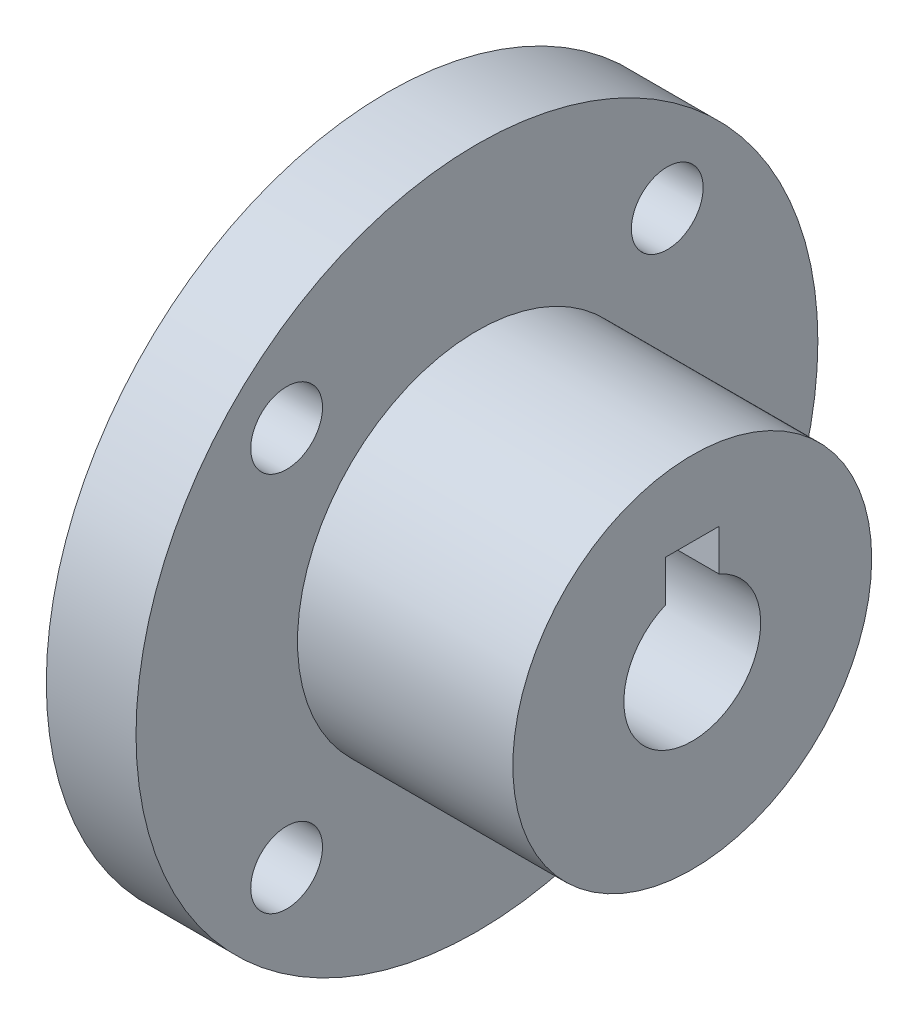
ISO-10303-21;
HEADER;
FILE_DESCRIPTION(('STEP AP214'),'2;1');
FILE_NAME('part.step','',(''),(''),'','','');
FILE_SCHEMA(('AUTOMOTIVE_DESIGN { 1 0 10303 214 1 1 1 1 }'));
ENDSEC;
DATA;
#1=APPLICATION_CONTEXT('core data for automotive mechanical design processes');
#2=APPLICATION_PROTOCOL_DEFINITION('international standard','automotive_design',2000,#1);
#3=PRODUCT_CONTEXT('',#1,'mechanical');
#4=PRODUCT('Part','Part','',(#3));
#5=PRODUCT_RELATED_PRODUCT_CATEGORY('part','',(#4));
#6=PRODUCT_DEFINITION_FORMATION('','',#4);
#7=PRODUCT_DEFINITION_CONTEXT('part definition',#1,'design');
#8=PRODUCT_DEFINITION('design','',#6,#7);
#9=PRODUCT_DEFINITION_SHAPE('','',#8);
#10=(LENGTH_UNIT() NAMED_UNIT(*) SI_UNIT(.MILLI.,.METRE.));
#11=(NAMED_UNIT(*) PLANE_ANGLE_UNIT() SI_UNIT($,.RADIAN.));
#12=(NAMED_UNIT(*) SI_UNIT($,.STERADIAN.) SOLID_ANGLE_UNIT());
#13=UNCERTAINTY_MEASURE_WITH_UNIT(LENGTH_MEASURE(1.E-05),#10,'distance_accuracy_value','');
#14=(GEOMETRIC_REPRESENTATION_CONTEXT(3) GLOBAL_UNCERTAINTY_ASSIGNED_CONTEXT((#13)) GLOBAL_UNIT_ASSIGNED_CONTEXT((#10,
#11,#12)) REPRESENTATION_CONTEXT('',''));
#15=CARTESIAN_POINT('',(0.,0.,0.));
#16=DIRECTION('',(0.,0.,1.));
#17=DIRECTION('',(1.,0.,0.));
#18=AXIS2_PLACEMENT_3D('',#15,#16,#17);
#19=CARTESIAN_POINT('',(12.,0.,0.));
#20=DIRECTION('',(-1.,0.,0.));
#21=DIRECTION('',(0.,0.,1.));
#22=AXIS2_PLACEMENT_3D('',#19,#20,#21);
#23=CYLINDRICAL_SURFACE('',#22,10.);
#24=CARTESIAN_POINT('',(12.,0.,0.));
#25=DIRECTION('',(1.,0.,0.));
#26=DIRECTION('',(0.,0.,-1.));
#27=AXIS2_PLACEMENT_3D('',#24,#25,#26);
#28=CIRCLE('',#27,10.);
#29=CARTESIAN_POINT('',(12.,0.,-10.));
#30=VERTEX_POINT('',#29);
#31=EDGE_CURVE('E135',#30,#30,#28,.T.);
#32=ORIENTED_EDGE('',*,*,#31,.F.);
#33=EDGE_LOOP('',(#32));
#34=FACE_BOUND('',#33,.T.);
#35=CARTESIAN_POINT('',(0.,0.,0.));
#36=DIRECTION('',(1.,0.,0.));
#37=DIRECTION('',(0.,0.,-1.));
#38=AXIS2_PLACEMENT_3D('',#35,#36,#37);
#39=CIRCLE('',#38,10.);
#40=CARTESIAN_POINT('',(0.,0.,-10.));
#41=VERTEX_POINT('',#40);
#42=EDGE_CURVE('E132',#41,#41,#39,.T.);
#43=ORIENTED_EDGE('',*,*,#42,.T.);
#44=EDGE_LOOP('',(#43));
#45=FACE_BOUND('',#44,.T.);
#46=ADVANCED_FACE('F33',(#34,#45),#23,.T.);
#47=CARTESIAN_POINT('',(12.,0.,0.));
#48=DIRECTION('',(1.,0.,0.));
#49=DIRECTION('',(0.,0.,-1.));
#50=AXIS2_PLACEMENT_3D('',#47,#48,#49);
#51=PLANE('',#50);
#52=DIRECTION('',(0.,-1.,0.));
#53=VECTOR('',#52,1.);
#54=CARTESIAN_POINT('',(12.,5.8125,1.5));
#55=LINE('',#54,#53);
#56=CARTESIAN_POINT('',(12.,5.8125,1.5));
#57=VERTEX_POINT('',#56);
#58=CARTESIAN_POINT('',(12.,3.50501872320249,1.5));
#59=VERTEX_POINT('',#58);
#60=EDGE_CURVE('E95',#57,#59,#55,.T.);
#61=ORIENTED_EDGE('',*,*,#60,.F.);
#62=DIRECTION('',(0.,0.,1.));
#63=VECTOR('',#62,1.);
#64=CARTESIAN_POINT('',(12.,5.8125,1.5));
#65=LINE('',#64,#63);
#66=CARTESIAN_POINT('',(12.,5.8125,-1.5));
#67=VERTEX_POINT('',#66);
#68=EDGE_CURVE('E92',#67,#57,#65,.T.);
#69=ORIENTED_EDGE('',*,*,#68,.F.);
#70=DIRECTION('',(0.,1.,0.));
#71=VECTOR('',#70,1.);
#72=CARTESIAN_POINT('',(12.,5.8125,-1.5));
#73=LINE('',#72,#71);
#74=CARTESIAN_POINT('',(12.,3.50501872320249,-1.5));
#75=VERTEX_POINT('',#74);
#76=EDGE_CURVE('E74',#75,#67,#73,.T.);
#77=ORIENTED_EDGE('',*,*,#76,.F.);
#78=CARTESIAN_POINT('',(12.,0.,0.));
#79=DIRECTION('',(1.,0.,0.));
#80=DIRECTION('',(0.,0.,-1.));
#81=AXIS2_PLACEMENT_3D('',#78,#79,#80);
#82=CIRCLE('',#81,3.8125);
#83=EDGE_CURVE('E99',#59,#75,#82,.T.);
#84=ORIENTED_EDGE('',*,*,#83,.F.);
#85=EDGE_LOOP('',(#61,#69,#77,#84));
#86=FACE_BOUND('',#85,.T.);
#87=ORIENTED_EDGE('',*,*,#31,.T.);
#88=EDGE_LOOP('',(#87));
#89=FACE_BOUND('',#88,.T.);
#90=ADVANCED_FACE('F144',(#86,#89),#51,.T.);
#91=CARTESIAN_POINT('',(-5.,0.,0.));
#92=DIRECTION('',(-1.,0.,0.));
#93=DIRECTION('',(0.,0.,1.));
#94=AXIS2_PLACEMENT_3D('',#91,#92,#93);
#95=PLANE('',#94);
#96=DIRECTION('',(0.,-1.,0.));
#97=VECTOR('',#96,1.);
#98=CARTESIAN_POINT('',(-5.,5.8125,1.5));
#99=LINE('',#98,#97);
#100=CARTESIAN_POINT('',(-5.,5.8125,1.5));
#101=VERTEX_POINT('',#100);
#102=CARTESIAN_POINT('',(-5.,3.50501872320249,1.5));
#103=VERTEX_POINT('',#102);
#104=EDGE_CURVE('E90',#101,#103,#99,.T.);
#105=ORIENTED_EDGE('',*,*,#104,.T.);
#106=CARTESIAN_POINT('',(-5.,0.,0.));
#107=DIRECTION('',(1.,0.,0.));
#108=DIRECTION('',(0.,0.,-1.));
#109=AXIS2_PLACEMENT_3D('',#106,#107,#108);
#110=CIRCLE('',#109,3.8125);
#111=CARTESIAN_POINT('',(-5.,3.50501872320249,-1.5));
#112=VERTEX_POINT('',#111);
#113=EDGE_CURVE('E89',#103,#112,#110,.T.);
#114=ORIENTED_EDGE('',*,*,#113,.T.);
#115=DIRECTION('',(0.,1.,0.));
#116=VECTOR('',#115,1.);
#117=CARTESIAN_POINT('',(-5.,5.8125,-1.5));
#118=LINE('',#117,#116);
#119=CARTESIAN_POINT('',(-5.,5.8125,-1.5));
#120=VERTEX_POINT('',#119);
#121=EDGE_CURVE('E47',#112,#120,#118,.T.);
#122=ORIENTED_EDGE('',*,*,#121,.T.);
#123=DIRECTION('',(0.,0.,1.));
#124=VECTOR('',#123,1.);
#125=CARTESIAN_POINT('',(-5.,5.8125,1.5));
#126=LINE('',#125,#124);
#127=EDGE_CURVE('E79',#120,#101,#126,.T.);
#128=ORIENTED_EDGE('',*,*,#127,.T.);
#129=EDGE_LOOP('',(#105,#114,#122,#128));
#130=FACE_BOUND('',#129,.T.);
#131=CARTESIAN_POINT('',(-5.,-10.6066017177982,10.6066017177982));
#132=DIRECTION('',(-1.,0.,0.));
#133=DIRECTION('',(0.,0.,1.));
#134=AXIS2_PLACEMENT_3D('',#131,#132,#133);
#135=CIRCLE('',#134,2.);
#136=CARTESIAN_POINT('',(-5.,-10.6066017177982,12.6066017177982));
#137=VERTEX_POINT('',#136);
#138=EDGE_CURVE('E111',#137,#137,#135,.T.);
#139=ORIENTED_EDGE('',*,*,#138,.F.);
#140=EDGE_LOOP('',(#139));
#141=FACE_BOUND('',#140,.T.);
#142=CARTESIAN_POINT('',(-5.,10.6066017177982,-10.6066017177982));
#143=DIRECTION('',(-1.,0.,0.));
#144=DIRECTION('',(0.,0.,1.));
#145=AXIS2_PLACEMENT_3D('',#142,#143,#144);
#146=CIRCLE('',#145,2.);
#147=CARTESIAN_POINT('',(-5.,10.6066017177982,-8.60660171779822));
#148=VERTEX_POINT('',#147);
#149=EDGE_CURVE('E123',#148,#148,#146,.T.);
#150=ORIENTED_EDGE('',*,*,#149,.F.);
#151=EDGE_LOOP('',(#150));
#152=FACE_BOUND('',#151,.T.);
#153=CARTESIAN_POINT('',(-5.,0.,0.));
#154=DIRECTION('',(-1.,0.,0.));
#155=DIRECTION('',(0.,0.,1.));
#156=AXIS2_PLACEMENT_3D('',#153,#154,#155);
#157=CIRCLE('',#156,19.);
#158=CARTESIAN_POINT('',(-5.,0.,19.));
#159=VERTEX_POINT('',#158);
#160=EDGE_CURVE('E129',#159,#159,#157,.T.);
#161=ORIENTED_EDGE('',*,*,#160,.T.);
#162=EDGE_LOOP('',(#161));
#163=FACE_BOUND('',#162,.T.);
#164=CARTESIAN_POINT('',(-5.,10.6066017177982,10.6066017177982));
#165=DIRECTION('',(-1.,0.,0.));
#166=DIRECTION('',(0.,0.,-1.));
#167=AXIS2_PLACEMENT_3D('',#164,#165,#166);
#168=CIRCLE('',#167,2.);
#169=CARTESIAN_POINT('',(-5.,10.6066017177982,8.60660171779821));
#170=VERTEX_POINT('',#169);
#171=EDGE_CURVE('E117',#170,#170,#168,.T.);
#172=ORIENTED_EDGE('',*,*,#171,.F.);
#173=EDGE_LOOP('',(#172));
#174=FACE_BOUND('',#173,.T.);
#175=CARTESIAN_POINT('',(-5.,-10.6066017177982,-10.6066017177982));
#176=DIRECTION('',(-1.,0.,0.));
#177=DIRECTION('',(0.,0.,-1.));
#178=AXIS2_PLACEMENT_3D('',#175,#176,#177);
#179=CIRCLE('',#178,2.);
#180=CARTESIAN_POINT('',(-5.,-10.6066017177982,-12.6066017177982));
#181=VERTEX_POINT('',#180);
#182=EDGE_CURVE('E105',#181,#181,#179,.T.);
#183=ORIENTED_EDGE('',*,*,#182,.F.);
#184=EDGE_LOOP('',(#183));
#185=FACE_BOUND('',#184,.T.);
#186=ADVANCED_FACE('F86',(#130,#141,#152,#163,#174,#185),#95,.T.);
#187=CARTESIAN_POINT('',(0.,0.,0.));
#188=DIRECTION('',(-1.,0.,0.));
#189=DIRECTION('',(0.,0.,1.));
#190=AXIS2_PLACEMENT_3D('',#187,#188,#189);
#191=PLANE('',#190);
#192=ORIENTED_EDGE('',*,*,#42,.F.);
#193=EDGE_LOOP('',(#192));
#194=FACE_BOUND('',#193,.T.);
#195=CARTESIAN_POINT('',(0.,0.,0.));
#196=DIRECTION('',(-1.,0.,0.));
#197=DIRECTION('',(0.,0.,1.));
#198=AXIS2_PLACEMENT_3D('',#195,#196,#197);
#199=CIRCLE('',#198,19.);
#200=CARTESIAN_POINT('',(0.,0.,19.));
#201=VERTEX_POINT('',#200);
#202=EDGE_CURVE('E126',#201,#201,#199,.T.);
#203=ORIENTED_EDGE('',*,*,#202,.F.);
#204=EDGE_LOOP('',(#203));
#205=FACE_BOUND('',#204,.T.);
#206=CARTESIAN_POINT('',(0.,10.6066017177982,-10.6066017177982));
#207=DIRECTION('',(-1.,0.,0.));
#208=DIRECTION('',(0.,0.,1.));
#209=AXIS2_PLACEMENT_3D('',#206,#207,#208);
#210=CIRCLE('',#209,2.);
#211=CARTESIAN_POINT('',(0.,10.6066017177982,-8.60660171779822));
#212=VERTEX_POINT('',#211);
#213=EDGE_CURVE('E120',#212,#212,#210,.T.);
#214=ORIENTED_EDGE('',*,*,#213,.T.);
#215=EDGE_LOOP('',(#214));
#216=FACE_BOUND('',#215,.T.);
#217=CARTESIAN_POINT('',(0.,10.6066017177982,10.6066017177982));
#218=DIRECTION('',(-1.,0.,0.));
#219=DIRECTION('',(0.,0.,-1.));
#220=AXIS2_PLACEMENT_3D('',#217,#218,#219);
#221=CIRCLE('',#220,2.);
#222=CARTESIAN_POINT('',(0.,10.6066017177982,8.60660171779821));
#223=VERTEX_POINT('',#222);
#224=EDGE_CURVE('E114',#223,#223,#221,.T.);
#225=ORIENTED_EDGE('',*,*,#224,.T.);
#226=EDGE_LOOP('',(#225));
#227=FACE_BOUND('',#226,.T.);
#228=CARTESIAN_POINT('',(0.,-10.6066017177982,10.6066017177982));
#229=DIRECTION('',(-1.,0.,0.));
#230=DIRECTION('',(0.,0.,1.));
#231=AXIS2_PLACEMENT_3D('',#228,#229,#230);
#232=CIRCLE('',#231,2.);
#233=CARTESIAN_POINT('',(0.,-10.6066017177982,12.6066017177982));
#234=VERTEX_POINT('',#233);
#235=EDGE_CURVE('E108',#234,#234,#232,.T.);
#236=ORIENTED_EDGE('',*,*,#235,.T.);
#237=EDGE_LOOP('',(#236));
#238=FACE_BOUND('',#237,.T.);
#239=CARTESIAN_POINT('',(0.,-10.6066017177982,-10.6066017177982));
#240=DIRECTION('',(-1.,0.,0.));
#241=DIRECTION('',(0.,0.,-1.));
#242=AXIS2_PLACEMENT_3D('',#239,#240,#241);
#243=CIRCLE('',#242,2.);
#244=CARTESIAN_POINT('',(0.,-10.6066017177982,-12.6066017177982));
#245=VERTEX_POINT('',#244);
#246=EDGE_CURVE('E102',#245,#245,#243,.T.);
#247=ORIENTED_EDGE('',*,*,#246,.T.);
#248=EDGE_LOOP('',(#247));
#249=FACE_BOUND('',#248,.T.);
#250=ADVANCED_FACE('F165',(#194,#205,#216,#227,#238,#249),#191,.F.);
#251=CARTESIAN_POINT('',(-5.,0.,0.));
#252=DIRECTION('',(1.,0.,0.));
#253=DIRECTION('',(0.,0.,-1.));
#254=AXIS2_PLACEMENT_3D('',#251,#252,#253);
#255=CYLINDRICAL_SURFACE('',#254,19.);
#256=ORIENTED_EDGE('',*,*,#160,.F.);
#257=EDGE_LOOP('',(#256));
#258=FACE_BOUND('',#257,.T.);
#259=ORIENTED_EDGE('',*,*,#202,.T.);
#260=EDGE_LOOP('',(#259));
#261=FACE_BOUND('',#260,.T.);
#262=ADVANCED_FACE('F168',(#258,#261),#255,.T.);
#263=CARTESIAN_POINT('',(-5.,10.6066017177982,-10.6066017177982));
#264=DIRECTION('',(1.,0.,0.));
#265=DIRECTION('',(0.,0.,-1.));
#266=AXIS2_PLACEMENT_3D('',#263,#264,#265);
#267=CYLINDRICAL_SURFACE('',#266,2.);
#268=ORIENTED_EDGE('',*,*,#149,.T.);
#269=EDGE_LOOP('',(#268));
#270=FACE_BOUND('',#269,.T.);
#271=ORIENTED_EDGE('',*,*,#213,.F.);
#272=EDGE_LOOP('',(#271));
#273=FACE_BOUND('',#272,.T.);
#274=ADVANCED_FACE('F193',(#270,#273),#267,.F.);
#275=CARTESIAN_POINT('',(-5.,10.6066017177982,10.6066017177982));
#276=DIRECTION('',(1.,0.,0.));
#277=DIRECTION('',(0.,0.,-1.));
#278=AXIS2_PLACEMENT_3D('',#275,#276,#277);
#279=CYLINDRICAL_SURFACE('',#278,2.);
#280=ORIENTED_EDGE('',*,*,#171,.T.);
#281=EDGE_LOOP('',(#280));
#282=FACE_BOUND('',#281,.T.);
#283=ORIENTED_EDGE('',*,*,#224,.F.);
#284=EDGE_LOOP('',(#283));
#285=FACE_BOUND('',#284,.T.);
#286=ADVANCED_FACE('F187',(#282,#285),#279,.F.);
#287=CARTESIAN_POINT('',(-5.,-10.6066017177982,10.6066017177982));
#288=DIRECTION('',(1.,0.,0.));
#289=DIRECTION('',(0.,0.,-1.));
#290=AXIS2_PLACEMENT_3D('',#287,#288,#289);
#291=CYLINDRICAL_SURFACE('',#290,2.);
#292=ORIENTED_EDGE('',*,*,#138,.T.);
#293=EDGE_LOOP('',(#292));
#294=FACE_BOUND('',#293,.T.);
#295=ORIENTED_EDGE('',*,*,#235,.F.);
#296=EDGE_LOOP('',(#295));
#297=FACE_BOUND('',#296,.T.);
#298=ADVANCED_FACE('F181',(#294,#297),#291,.F.);
#299=CARTESIAN_POINT('',(-5.,-10.6066017177982,-10.6066017177982));
#300=DIRECTION('',(1.,0.,0.));
#301=DIRECTION('',(0.,0.,-1.));
#302=AXIS2_PLACEMENT_3D('',#299,#300,#301);
#303=CYLINDRICAL_SURFACE('',#302,2.);
#304=ORIENTED_EDGE('',*,*,#182,.T.);
#305=EDGE_LOOP('',(#304));
#306=FACE_BOUND('',#305,.T.);
#307=ORIENTED_EDGE('',*,*,#246,.F.);
#308=EDGE_LOOP('',(#307));
#309=FACE_BOUND('',#308,.T.);
#310=ADVANCED_FACE('F154',(#306,#309),#303,.F.);
#311=CARTESIAN_POINT('',(-5.,0.,0.));
#312=DIRECTION('',(1.,0.,0.));
#313=DIRECTION('',(0.,0.,-1.));
#314=AXIS2_PLACEMENT_3D('',#311,#312,#313);
#315=CYLINDRICAL_SURFACE('',#314,3.8125);
#316=ORIENTED_EDGE('',*,*,#113,.F.);
#317=DIRECTION('',(1.,0.,0.));
#318=VECTOR('',#317,1.);
#319=CARTESIAN_POINT('',(-5.,3.50501872320249,1.5));
#320=LINE('',#319,#318);
#321=EDGE_CURVE('E11',#103,#59,#320,.T.);
#322=ORIENTED_EDGE('',*,*,#321,.T.);
#323=ORIENTED_EDGE('',*,*,#83,.T.);
#324=DIRECTION('',(1.,0.,0.));
#325=VECTOR('',#324,1.);
#326=CARTESIAN_POINT('',(-5.,3.50501872320249,-1.5));
#327=LINE('',#326,#325);
#328=EDGE_CURVE('E40',#75,#112,#327,.F.);
#329=ORIENTED_EDGE('',*,*,#328,.T.);
#330=EDGE_LOOP('',(#316,#322,#323,#329));
#331=FACE_BOUND('',#330,.T.);
#332=ADVANCED_FACE('F140',(#331),#315,.F.);
#333=CARTESIAN_POINT('',(-5.,5.8125,1.5));
#334=DIRECTION('',(0.,0.,1.));
#335=DIRECTION('',(0.,-1.,0.));
#336=AXIS2_PLACEMENT_3D('',#333,#334,#335);
#337=PLANE('',#336);
#338=ORIENTED_EDGE('',*,*,#104,.F.);
#339=DIRECTION('',(1.,0.,0.));
#340=VECTOR('',#339,1.);
#341=CARTESIAN_POINT('',(-5.,5.8125,1.5));
#342=LINE('',#341,#340);
#343=EDGE_CURVE('E78',#101,#57,#342,.T.);
#344=ORIENTED_EDGE('',*,*,#343,.T.);
#345=ORIENTED_EDGE('',*,*,#60,.T.);
#346=ORIENTED_EDGE('',*,*,#321,.F.);
#347=EDGE_LOOP('',(#338,#344,#345,#346));
#348=FACE_BOUND('',#347,.T.);
#349=ADVANCED_FACE('F146',(#348),#337,.F.);
#350=CARTESIAN_POINT('',(-5.,5.8125,-1.5));
#351=DIRECTION('',(0.,0.,-1.));
#352=DIRECTION('',(0.,1.,0.));
#353=AXIS2_PLACEMENT_3D('',#350,#351,#352);
#354=PLANE('',#353);
#355=ORIENTED_EDGE('',*,*,#76,.T.);
#356=DIRECTION('',(1.,0.,0.));
#357=VECTOR('',#356,1.);
#358=CARTESIAN_POINT('',(-5.,5.8125,-1.5));
#359=LINE('',#358,#357);
#360=EDGE_CURVE('E70',#120,#67,#359,.T.);
#361=ORIENTED_EDGE('',*,*,#360,.F.);
#362=ORIENTED_EDGE('',*,*,#121,.F.);
#363=ORIENTED_EDGE('',*,*,#328,.F.);
#364=EDGE_LOOP('',(#355,#361,#362,#363));
#365=FACE_BOUND('',#364,.T.);
#366=ADVANCED_FACE('F72',(#365),#354,.F.);
#367=CARTESIAN_POINT('',(-5.,5.8125,1.5));
#368=DIRECTION('',(0.,1.,0.));
#369=DIRECTION('',(0.,0.,1.));
#370=AXIS2_PLACEMENT_3D('',#367,#368,#369);
#371=PLANE('',#370);
#372=ORIENTED_EDGE('',*,*,#68,.T.);
#373=ORIENTED_EDGE('',*,*,#343,.F.);
#374=ORIENTED_EDGE('',*,*,#127,.F.);
#375=ORIENTED_EDGE('',*,*,#360,.T.);
#376=EDGE_LOOP('',(#372,#373,#374,#375));
#377=FACE_BOUND('',#376,.T.);
#378=ADVANCED_FACE('F82',(#377),#371,.F.);
#379=CLOSED_SHELL('',(#46,#90,#186,#250,#262,#274,#286,#298,#310,#332,#349,#366,#378));
#380=MANIFOLD_SOLID_BREP('B2',#379);
#381=ADVANCED_BREP_SHAPE_REPRESENTATION('',(#18,#380),#14);
#382=SHAPE_DEFINITION_REPRESENTATION(#9,#381);
ENDSEC;
END-ISO-10303-21;
